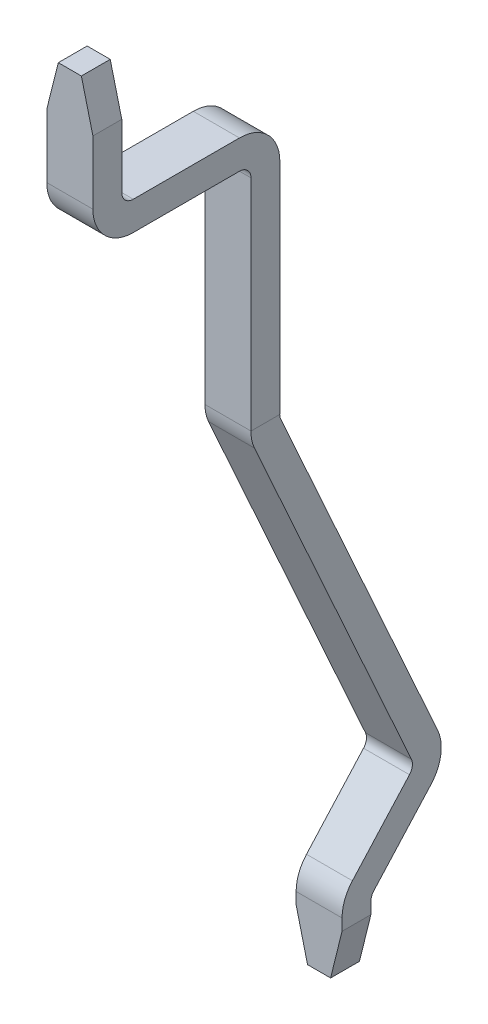
ISO-10303-21;
HEADER;
FILE_DESCRIPTION(('STEP AP214'),'2;1');
FILE_NAME('part.step','',(''),(''),'','','');
FILE_SCHEMA(('AUTOMOTIVE_DESIGN { 1 0 10303 214 1 1 1 1 }'));
ENDSEC;
DATA;
#1=APPLICATION_CONTEXT('core data for automotive mechanical design processes');
#2=APPLICATION_PROTOCOL_DEFINITION('international standard','automotive_design',2000,#1);
#3=PRODUCT_CONTEXT('',#1,'mechanical');
#4=PRODUCT('Part','Part','',(#3));
#5=PRODUCT_RELATED_PRODUCT_CATEGORY('part','',(#4));
#6=PRODUCT_DEFINITION_FORMATION('','',#4);
#7=PRODUCT_DEFINITION_CONTEXT('part definition',#1,'design');
#8=PRODUCT_DEFINITION('design','',#6,#7);
#9=PRODUCT_DEFINITION_SHAPE('','',#8);
#10=(LENGTH_UNIT() NAMED_UNIT(*) SI_UNIT(.MILLI.,.METRE.));
#11=(NAMED_UNIT(*) PLANE_ANGLE_UNIT() SI_UNIT($,.RADIAN.));
#12=(NAMED_UNIT(*) SI_UNIT($,.STERADIAN.) SOLID_ANGLE_UNIT());
#13=UNCERTAINTY_MEASURE_WITH_UNIT(LENGTH_MEASURE(1.E-05),#10,'distance_accuracy_value','');
#14=(GEOMETRIC_REPRESENTATION_CONTEXT(3) GLOBAL_UNCERTAINTY_ASSIGNED_CONTEXT((#13)) GLOBAL_UNIT_ASSIGNED_CONTEXT((#10,
#11,#12)) REPRESENTATION_CONTEXT('',''));
#15=CARTESIAN_POINT('',(0.,0.,0.));
#16=DIRECTION('',(0.,0.,1.));
#17=DIRECTION('',(1.,0.,0.));
#18=AXIS2_PLACEMENT_3D('',#15,#16,#17);
#19=CARTESIAN_POINT('',(0.,4.575,1.945));
#20=DIRECTION('',(0.,-1.,0.));
#21=DIRECTION('',(0.,0.,-1.));
#22=AXIS2_PLACEMENT_3D('',#19,#20,#21);
#23=PLANE('',#22);
#24=DIRECTION('',(0.,0.,1.));
#25=VECTOR('',#24,1.);
#26=CARTESIAN_POINT('',(-0.0999999999999935,4.575,8.99552393868072));
#27=LINE('',#26,#25);
#28=CARTESIAN_POINT('',(-0.0999999999999935,4.575,1.82));
#29=VERTEX_POINT('',#28);
#30=CARTESIAN_POINT('',(-0.0999999999999935,4.575,2.07));
#31=VERTEX_POINT('',#30);
#32=EDGE_CURVE('E264',#29,#31,#27,.T.);
#33=ORIENTED_EDGE('',*,*,#32,.T.);
#34=DIRECTION('',(-1.,0.,0.));
#35=VECTOR('',#34,1.);
#36=CARTESIAN_POINT('',(0.200000000000006,4.575,2.07));
#37=LINE('',#36,#35);
#38=CARTESIAN_POINT('',(0.100000000000006,4.575,2.07));
#39=VERTEX_POINT('',#38);
#40=EDGE_CURVE('E235',#31,#39,#37,.F.);
#41=ORIENTED_EDGE('',*,*,#40,.T.);
#42=DIRECTION('',(0.,0.,1.));
#43=VECTOR('',#42,1.);
#44=CARTESIAN_POINT('',(0.100000000000006,4.575,8.99552883706733));
#45=LINE('',#44,#43);
#46=CARTESIAN_POINT('',(0.100000000000006,4.575,1.82));
#47=VERTEX_POINT('',#46);
#48=EDGE_CURVE('E214',#47,#39,#45,.T.);
#49=ORIENTED_EDGE('',*,*,#48,.F.);
#50=DIRECTION('',(1.,0.,0.));
#51=VECTOR('',#50,1.);
#52=CARTESIAN_POINT('',(-0.199999999999994,4.575,1.82));
#53=LINE('',#52,#51);
#54=EDGE_CURVE('E251',#47,#29,#53,.F.);
#55=ORIENTED_EDGE('',*,*,#54,.T.);
#56=EDGE_LOOP('',(#33,#41,#49,#55));
#57=FACE_BOUND('',#56,.T.);
#58=ADVANCED_FACE('F17',(#57),#23,.F.);
#59=CARTESIAN_POINT('',(-0.0999999999999935,4.575,8.99552393868072));
#60=DIRECTION('',(0.970142500145331,-0.242535625036336,0.));
#61=DIRECTION('',(0.242535625036336,0.970142500145331,0.));
#62=AXIS2_PLACEMENT_3D('',#59,#60,#61);
#63=PLANE('',#62);
#64=DIRECTION('',(0.242535625036333,0.970142500145332,0.));
#65=VECTOR('',#64,1.);
#66=CARTESIAN_POINT('',(-0.199999999999994,4.175,2.07));
#67=LINE('',#66,#65);
#68=CARTESIAN_POINT('',(-0.199999999999994,4.175,2.07));
#69=VERTEX_POINT('',#68);
#70=EDGE_CURVE('E202',#69,#31,#67,.T.);
#71=ORIENTED_EDGE('',*,*,#70,.T.);
#72=ORIENTED_EDGE('',*,*,#32,.F.);
#73=DIRECTION('',(-0.242535625036333,-0.970142500145332,0.));
#74=VECTOR('',#73,1.);
#75=CARTESIAN_POINT('',(-0.0999999999999935,4.575,1.82));
#76=LINE('',#75,#74);
#77=CARTESIAN_POINT('',(-0.199999999999994,4.175,1.82));
#78=VERTEX_POINT('',#77);
#79=EDGE_CURVE('E231',#29,#78,#76,.T.);
#80=ORIENTED_EDGE('',*,*,#79,.T.);
#81=DIRECTION('',(0.,0.,1.));
#82=VECTOR('',#81,1.);
#83=CARTESIAN_POINT('',(-0.199999999999994,4.175,2.07));
#84=LINE('',#83,#82);
#85=EDGE_CURVE('E242',#78,#69,#84,.T.);
#86=ORIENTED_EDGE('',*,*,#85,.T.);
#87=EDGE_LOOP('',(#71,#72,#80,#86));
#88=FACE_BOUND('',#87,.T.);
#89=ADVANCED_FACE('F401',(#88),#63,.F.);
#90=CARTESIAN_POINT('',(-0.199999999999994,4.575,1.82));
#91=DIRECTION('',(0.,0.,1.));
#92=DIRECTION('',(0.,-1.,0.));
#93=AXIS2_PLACEMENT_3D('',#90,#91,#92);
#94=PLANE('',#93);
#95=ORIENTED_EDGE('',*,*,#79,.F.);
#96=ORIENTED_EDGE('',*,*,#54,.F.);
#97=DIRECTION('',(-0.242535625036336,0.970142500145331,0.));
#98=VECTOR('',#97,1.);
#99=CARTESIAN_POINT('',(0.100000000000006,4.575,1.82));
#100=LINE('',#99,#98);
#101=CARTESIAN_POINT('',(0.200000000000007,4.175,1.82));
#102=VERTEX_POINT('',#101);
#103=EDGE_CURVE('E232',#102,#47,#100,.T.);
#104=ORIENTED_EDGE('',*,*,#103,.F.);
#105=DIRECTION('',(0.,1.,0.));
#106=VECTOR('',#105,1.);
#107=CARTESIAN_POINT('',(0.200000000000006,4.575,1.82));
#108=LINE('',#107,#106);
#109=CARTESIAN_POINT('',(0.200000000000006,3.625,1.82));
#110=VERTEX_POINT('',#109);
#111=EDGE_CURVE('E221',#102,#110,#108,.F.);
#112=ORIENTED_EDGE('',*,*,#111,.T.);
#113=DIRECTION('',(1.,0.,0.));
#114=VECTOR('',#113,1.);
#115=CARTESIAN_POINT('',(0.,3.625,1.81999999999999));
#116=LINE('',#115,#114);
#117=CARTESIAN_POINT('',(-0.199999999999994,3.625,1.82));
#118=VERTEX_POINT('',#117);
#119=EDGE_CURVE('E229',#110,#118,#116,.F.);
#120=ORIENTED_EDGE('',*,*,#119,.T.);
#121=DIRECTION('',(0.,1.,0.));
#122=VECTOR('',#121,1.);
#123=CARTESIAN_POINT('',(-0.199999999999994,4.575,1.82));
#124=LINE('',#123,#122);
#125=EDGE_CURVE('E246',#118,#78,#124,.T.);
#126=ORIENTED_EDGE('',*,*,#125,.T.);
#127=EDGE_LOOP('',(#95,#96,#104,#112,#120,#126));
#128=FACE_BOUND('',#127,.T.);
#129=ADVANCED_FACE('F396',(#128),#94,.F.);
#130=CARTESIAN_POINT('',(0.,3.625,1.72));
#131=DIRECTION('',(1.,0.,0.));
#132=DIRECTION('',(0.,1.,0.));
#133=AXIS2_PLACEMENT_3D('',#130,#131,#132);
#134=CYLINDRICAL_SURFACE('',#133,0.0999999999999946);
#135=ORIENTED_EDGE('',*,*,#119,.F.);
#136=CARTESIAN_POINT('',(0.200000000000006,3.625,1.72));
#137=DIRECTION('',(1.,0.,0.));
#138=DIRECTION('',(0.,1.,0.));
#139=AXIS2_PLACEMENT_3D('',#136,#137,#138);
#140=CIRCLE('',#139,0.0999999999999946);
#141=CARTESIAN_POINT('',(0.200000000000006,3.525,1.72));
#142=VERTEX_POINT('',#141);
#143=EDGE_CURVE('E335',#110,#142,#140,.T.);
#144=ORIENTED_EDGE('',*,*,#143,.T.);
#145=DIRECTION('',(1.,0.,0.));
#146=VECTOR('',#145,1.);
#147=CARTESIAN_POINT('',(-0.199999999999994,3.525,1.72));
#148=LINE('',#147,#146);
#149=CARTESIAN_POINT('',(-0.199999999999994,3.525,1.72));
#150=VERTEX_POINT('',#149);
#151=EDGE_CURVE('E227',#142,#150,#148,.F.);
#152=ORIENTED_EDGE('',*,*,#151,.T.);
#153=CARTESIAN_POINT('',(-0.199999999999994,3.625,1.72));
#154=DIRECTION('',(1.,0.,0.));
#155=DIRECTION('',(0.,1.,0.));
#156=AXIS2_PLACEMENT_3D('',#153,#154,#155);
#157=CIRCLE('',#156,0.0999999999999946);
#158=EDGE_CURVE('E340',#150,#118,#157,.F.);
#159=ORIENTED_EDGE('',*,*,#158,.T.);
#160=EDGE_LOOP('',(#135,#144,#152,#159));
#161=FACE_BOUND('',#160,.T.);
#162=ADVANCED_FACE('F393',(#161),#134,.F.);
#163=CARTESIAN_POINT('',(-0.199999999999994,3.525,1.72));
#164=DIRECTION('',(0.,-1.,0.));
#165=DIRECTION('',(0.,0.,-1.));
#166=AXIS2_PLACEMENT_3D('',#163,#164,#165);
#167=PLANE('',#166);
#168=ORIENTED_EDGE('',*,*,#151,.F.);
#169=DIRECTION('',(0.,0.,1.));
#170=VECTOR('',#169,1.);
#171=CARTESIAN_POINT('',(0.200000000000006,3.525,1.82));
#172=LINE('',#171,#170);
#173=CARTESIAN_POINT('',(0.200000000000006,3.525,0.800000000000004));
#174=VERTEX_POINT('',#173);
#175=EDGE_CURVE('E334',#142,#174,#172,.F.);
#176=ORIENTED_EDGE('',*,*,#175,.T.);
#177=DIRECTION('',(-1.,0.,0.));
#178=VECTOR('',#177,1.);
#179=CARTESIAN_POINT('',(0.,3.525,0.800000000000004));
#180=LINE('',#179,#178);
#181=CARTESIAN_POINT('',(-0.199999999999994,3.525,0.800000000000004));
#182=VERTEX_POINT('',#181);
#183=EDGE_CURVE('E178',#182,#174,#180,.F.);
#184=ORIENTED_EDGE('',*,*,#183,.F.);
#185=DIRECTION('',(0.,0.,1.));
#186=VECTOR('',#185,1.);
#187=CARTESIAN_POINT('',(-0.199999999999994,3.525,2.07));
#188=LINE('',#187,#186);
#189=EDGE_CURVE('E343',#182,#150,#188,.T.);
#190=ORIENTED_EDGE('',*,*,#189,.T.);
#191=EDGE_LOOP('',(#168,#176,#184,#190));
#192=FACE_BOUND('',#191,.T.);
#193=ADVANCED_FACE('F384',(#192),#167,.F.);
#194=CARTESIAN_POINT('',(0.,3.175,0.800000000000004));
#195=DIRECTION('',(-1.,0.,0.));
#196=DIRECTION('',(0.,-1.,0.));
#197=AXIS2_PLACEMENT_3D('',#194,#195,#196);
#198=CYLINDRICAL_SURFACE('',#197,0.350000000000005);
#199=CARTESIAN_POINT('',(0.200000000000006,3.175,0.800000000000004));
#200=DIRECTION('',(-1.,0.,0.));
#201=DIRECTION('',(0.,-1.,0.));
#202=AXIS2_PLACEMENT_3D('',#199,#200,#201);
#203=CIRCLE('',#202,0.350000000000005);
#204=CARTESIAN_POINT('',(0.200000000000004,3.175,0.45));
#205=VERTEX_POINT('',#204);
#206=EDGE_CURVE('E330',#174,#205,#203,.T.);
#207=ORIENTED_EDGE('',*,*,#206,.T.);
#208=DIRECTION('',(1.,0.,0.));
#209=VECTOR('',#208,1.);
#210=CARTESIAN_POINT('',(-0.199999999999994,3.175,0.45));
#211=LINE('',#210,#209);
#212=CARTESIAN_POINT('',(-0.199999999999994,3.175,0.45));
#213=VERTEX_POINT('',#212);
#214=EDGE_CURVE('E218',#205,#213,#211,.F.);
#215=ORIENTED_EDGE('',*,*,#214,.T.);
#216=CARTESIAN_POINT('',(-0.199999999999994,3.175,0.800000000000004));
#217=DIRECTION('',(-1.,0.,0.));
#218=DIRECTION('',(0.,-1.,0.));
#219=AXIS2_PLACEMENT_3D('',#216,#217,#218);
#220=CIRCLE('',#219,0.350000000000005);
#221=EDGE_CURVE('E188',#213,#182,#220,.F.);
#222=ORIENTED_EDGE('',*,*,#221,.T.);
#223=ORIENTED_EDGE('',*,*,#183,.T.);
#224=EDGE_LOOP('',(#207,#215,#222,#223));
#225=FACE_BOUND('',#224,.T.);
#226=ADVANCED_FACE('F389',(#225),#198,.T.);
#227=CARTESIAN_POINT('',(-0.199999999999994,3.175,0.45));
#228=DIRECTION('',(0.,0.,1.));
#229=DIRECTION('',(0.,-1.,0.));
#230=AXIS2_PLACEMENT_3D('',#227,#228,#229);
#231=PLANE('',#230);
#232=ORIENTED_EDGE('',*,*,#214,.F.);
#233=DIRECTION('',(0.,1.,0.));
#234=VECTOR('',#233,1.);
#235=CARTESIAN_POINT('',(0.200000000000002,4.575,0.449999999999999));
#236=LINE('',#235,#234);
#237=CARTESIAN_POINT('',(0.200000000000002,1.275,0.449999999999999));
#238=VERTEX_POINT('',#237);
#239=EDGE_CURVE('E333',#205,#238,#236,.F.);
#240=ORIENTED_EDGE('',*,*,#239,.T.);
#241=DIRECTION('',(1.,0.,0.));
#242=VECTOR('',#241,1.);
#243=CARTESIAN_POINT('',(0.198999999999996,1.275,0.449999999999998));
#244=LINE('',#243,#242);
#245=CARTESIAN_POINT('',(0.199000000000002,1.275,0.449999999999999));
#246=VERTEX_POINT('',#245);
#247=EDGE_CURVE('E224',#246,#238,#244,.T.);
#248=ORIENTED_EDGE('',*,*,#247,.F.);
#249=DIRECTION('',(1.,0.,0.));
#250=VECTOR('',#249,1.);
#251=CARTESIAN_POINT('',(-0.199999999999994,1.275,0.45));
#252=LINE('',#251,#250);
#253=CARTESIAN_POINT('',(-0.198999999999989,1.275,0.449999999999999));
#254=VERTEX_POINT('',#253);
#255=EDGE_CURVE('E174',#254,#246,#252,.T.);
#256=ORIENTED_EDGE('',*,*,#255,.F.);
#257=DIRECTION('',(1.,0.,0.));
#258=VECTOR('',#257,1.);
#259=CARTESIAN_POINT('',(-0.19899999999999,1.275,0.45));
#260=LINE('',#259,#258);
#261=CARTESIAN_POINT('',(-0.199999999999994,1.275,0.45));
#262=VERTEX_POINT('',#261);
#263=EDGE_CURVE('E20',#262,#254,#260,.T.);
#264=ORIENTED_EDGE('',*,*,#263,.F.);
#265=DIRECTION('',(0.,1.,0.));
#266=VECTOR('',#265,1.);
#267=CARTESIAN_POINT('',(-0.199999999999994,4.575,0.45));
#268=LINE('',#267,#266);
#269=EDGE_CURVE('E172',#262,#213,#268,.T.);
#270=ORIENTED_EDGE('',*,*,#269,.T.);
#271=EDGE_LOOP('',(#232,#240,#248,#256,#264,#270));
#272=FACE_BOUND('',#271,.T.);
#273=ADVANCED_FACE('F171',(#272),#231,.F.);
#274=CARTESIAN_POINT('',(0.200000000000006,3.275,1.72));
#275=DIRECTION('',(0.,1.,0.));
#276=DIRECTION('',(0.,0.,1.));
#277=AXIS2_PLACEMENT_3D('',#274,#275,#276);
#278=PLANE('',#277);
#279=DIRECTION('',(1.,0.,0.));
#280=VECTOR('',#279,1.);
#281=CARTESIAN_POINT('',(0.,3.27500000000001,1.72));
#282=LINE('',#281,#280);
#283=CARTESIAN_POINT('',(-0.199999999999994,3.275,1.72));
#284=VERTEX_POINT('',#283);
#285=CARTESIAN_POINT('',(0.200000000000006,3.275,1.72));
#286=VERTEX_POINT('',#285);
#287=EDGE_CURVE('E203',#284,#286,#282,.T.);
#288=ORIENTED_EDGE('',*,*,#287,.F.);
#289=DIRECTION('',(0.,0.,1.));
#290=VECTOR('',#289,1.);
#291=CARTESIAN_POINT('',(-0.199999999999994,3.275,2.07));
#292=LINE('',#291,#290);
#293=CARTESIAN_POINT('',(-0.199999999999994,3.275,0.800000000000004));
#294=VERTEX_POINT('',#293);
#295=EDGE_CURVE('E194',#284,#294,#292,.F.);
#296=ORIENTED_EDGE('',*,*,#295,.T.);
#297=DIRECTION('',(-1.,0.,0.));
#298=VECTOR('',#297,1.);
#299=CARTESIAN_POINT('',(0.,3.275,0.800000000000004));
#300=LINE('',#299,#298);
#301=CARTESIAN_POINT('',(0.200000000000006,3.275,0.800000000000004));
#302=VERTEX_POINT('',#301);
#303=EDGE_CURVE('E219',#294,#302,#300,.F.);
#304=ORIENTED_EDGE('',*,*,#303,.T.);
#305=DIRECTION('',(0.,0.,1.));
#306=VECTOR('',#305,1.);
#307=CARTESIAN_POINT('',(0.200000000000006,3.275,1.82));
#308=LINE('',#307,#306);
#309=EDGE_CURVE('E325',#302,#286,#308,.T.);
#310=ORIENTED_EDGE('',*,*,#309,.T.);
#311=EDGE_LOOP('',(#288,#296,#304,#310));
#312=FACE_BOUND('',#311,.T.);
#313=ADVANCED_FACE('F535',(#312),#278,.F.);
#314=CARTESIAN_POINT('',(0.,3.625,1.72));
#315=DIRECTION('',(1.,0.,0.));
#316=DIRECTION('',(0.,1.,0.));
#317=AXIS2_PLACEMENT_3D('',#314,#315,#316);
#318=CYLINDRICAL_SURFACE('',#317,0.349999999999995);
#319=CARTESIAN_POINT('',(-0.199999999999994,3.625,1.72));
#320=DIRECTION('',(1.,0.,0.));
#321=DIRECTION('',(0.,1.,0.));
#322=AXIS2_PLACEMENT_3D('',#319,#320,#321);
#323=CIRCLE('',#322,0.349999999999995);
#324=CARTESIAN_POINT('',(-0.199999999999994,3.625,2.07));
#325=VERTEX_POINT('',#324);
#326=EDGE_CURVE('E196',#325,#284,#323,.T.);
#327=ORIENTED_EDGE('',*,*,#326,.T.);
#328=ORIENTED_EDGE('',*,*,#287,.T.);
#329=CARTESIAN_POINT('',(0.200000000000007,3.625,1.72));
#330=DIRECTION('',(1.,0.,0.));
#331=DIRECTION('',(0.,1.,0.));
#332=AXIS2_PLACEMENT_3D('',#329,#330,#331);
#333=CIRCLE('',#332,0.349999999999995);
#334=CARTESIAN_POINT('',(0.200000000000007,3.625,2.07));
#335=VERTEX_POINT('',#334);
#336=EDGE_CURVE('E322',#286,#335,#333,.F.);
#337=ORIENTED_EDGE('',*,*,#336,.T.);
#338=DIRECTION('',(-1.,0.,0.));
#339=VECTOR('',#338,1.);
#340=CARTESIAN_POINT('',(0.200000000000006,3.625,2.07));
#341=LINE('',#340,#339);
#342=EDGE_CURVE('E199',#335,#325,#341,.T.);
#343=ORIENTED_EDGE('',*,*,#342,.T.);
#344=EDGE_LOOP('',(#327,#328,#337,#343));
#345=FACE_BOUND('',#344,.T.);
#346=ADVANCED_FACE('F532',(#345),#318,.T.);
#347=CARTESIAN_POINT('',(0.200000000000006,4.575,2.07));
#348=DIRECTION('',(0.,0.,-1.));
#349=DIRECTION('',(-1.,0.,0.));
#350=AXIS2_PLACEMENT_3D('',#347,#348,#349);
#351=PLANE('',#350);
#352=ORIENTED_EDGE('',*,*,#70,.F.);
#353=DIRECTION('',(0.,1.,0.));
#354=VECTOR('',#353,1.);
#355=CARTESIAN_POINT('',(-0.199999999999994,4.575,2.07));
#356=LINE('',#355,#354);
#357=EDGE_CURVE('E245',#69,#325,#356,.F.);
#358=ORIENTED_EDGE('',*,*,#357,.T.);
#359=ORIENTED_EDGE('',*,*,#342,.F.);
#360=DIRECTION('',(0.,1.,0.));
#361=VECTOR('',#360,1.);
#362=CARTESIAN_POINT('',(0.200000000000007,4.575,2.07));
#363=LINE('',#362,#361);
#364=CARTESIAN_POINT('',(0.200000000000007,4.175,2.07));
#365=VERTEX_POINT('',#364);
#366=EDGE_CURVE('E208',#335,#365,#363,.T.);
#367=ORIENTED_EDGE('',*,*,#366,.T.);
#368=DIRECTION('',(-0.242535625036336,0.970142500145331,0.));
#369=VECTOR('',#368,1.);
#370=CARTESIAN_POINT('',(0.100000000000006,4.575,2.07));
#371=LINE('',#370,#369);
#372=EDGE_CURVE('E211',#39,#365,#371,.F.);
#373=ORIENTED_EDGE('',*,*,#372,.F.);
#374=ORIENTED_EDGE('',*,*,#40,.F.);
#375=EDGE_LOOP('',(#352,#358,#359,#367,#373,#374));
#376=FACE_BOUND('',#375,.T.);
#377=ADVANCED_FACE('F528',(#376),#351,.F.);
#378=CARTESIAN_POINT('',(0.100000000000006,4.575,8.99552883706733));
#379=DIRECTION('',(0.970142500145331,0.242535625036336,0.));
#380=DIRECTION('',(-0.242535625036336,0.970142500145331,0.));
#381=AXIS2_PLACEMENT_3D('',#378,#379,#380);
#382=PLANE('',#381);
#383=ORIENTED_EDGE('',*,*,#372,.T.);
#384=DIRECTION('',(0.,0.,1.));
#385=VECTOR('',#384,1.);
#386=CARTESIAN_POINT('',(0.200000000000006,4.175,1.82));
#387=LINE('',#386,#385);
#388=EDGE_CURVE('E204',#365,#102,#387,.F.);
#389=ORIENTED_EDGE('',*,*,#388,.T.);
#390=ORIENTED_EDGE('',*,*,#103,.T.);
#391=ORIENTED_EDGE('',*,*,#48,.T.);
#392=EDGE_LOOP('',(#383,#389,#390,#391));
#393=FACE_BOUND('',#392,.T.);
#394=ADVANCED_FACE('F525',(#393),#382,.T.);
#395=CARTESIAN_POINT('',(-0.199999999999994,4.575,2.07));
#396=DIRECTION('',(1.,0.,0.));
#397=DIRECTION('',(0.,1.,0.));
#398=AXIS2_PLACEMENT_3D('',#395,#396,#397);
#399=PLANE('',#398);
#400=ORIENTED_EDGE('',*,*,#85,.F.);
#401=ORIENTED_EDGE('',*,*,#125,.F.);
#402=ORIENTED_EDGE('',*,*,#158,.F.);
#403=ORIENTED_EDGE('',*,*,#189,.F.);
#404=ORIENTED_EDGE('',*,*,#221,.F.);
#405=ORIENTED_EDGE('',*,*,#269,.F.);
#406=DIRECTION('',(0.,0.,1.));
#407=VECTOR('',#406,1.);
#408=CARTESIAN_POINT('',(-0.199999999999994,1.275,2.07));
#409=LINE('',#408,#407);
#410=CARTESIAN_POINT('',(-0.199999999999992,1.275,0.7));
#411=VERTEX_POINT('',#410);
#412=EDGE_CURVE('E184',#411,#262,#409,.F.);
#413=ORIENTED_EDGE('',*,*,#412,.F.);
#414=DIRECTION('',(0.,1.,0.));
#415=VECTOR('',#414,1.);
#416=CARTESIAN_POINT('',(-0.19999999999999,3.175,0.7));
#417=LINE('',#416,#415);
#418=CARTESIAN_POINT('',(-0.199999999999992,3.175,0.7));
#419=VERTEX_POINT('',#418);
#420=EDGE_CURVE('E207',#411,#419,#417,.T.);
#421=ORIENTED_EDGE('',*,*,#420,.T.);
#422=CARTESIAN_POINT('',(-0.199999999999994,3.175,0.800000000000004));
#423=DIRECTION('',(-1.,0.,0.));
#424=DIRECTION('',(0.,-1.,0.));
#425=AXIS2_PLACEMENT_3D('',#422,#423,#424);
#426=CIRCLE('',#425,0.100000000000005);
#427=EDGE_CURVE('E222',#419,#294,#426,.F.);
#428=ORIENTED_EDGE('',*,*,#427,.T.);
#429=ORIENTED_EDGE('',*,*,#295,.F.);
#430=ORIENTED_EDGE('',*,*,#326,.F.);
#431=ORIENTED_EDGE('',*,*,#357,.F.);
#432=EDGE_LOOP('',(#400,#401,#402,#403,#404,#405,#413,#421,#428,#429,#430,#431));
#433=FACE_BOUND('',#432,.T.);
#434=ADVANCED_FACE('F182',(#433),#399,.F.);
#435=CARTESIAN_POINT('',(0.,3.175,0.800000000000004));
#436=DIRECTION('',(-1.,0.,0.));
#437=DIRECTION('',(0.,-1.,0.));
#438=AXIS2_PLACEMENT_3D('',#435,#436,#437);
#439=CYLINDRICAL_SURFACE('',#438,0.100000000000005);
#440=ORIENTED_EDGE('',*,*,#303,.F.);
#441=ORIENTED_EDGE('',*,*,#427,.F.);
#442=DIRECTION('',(-1.,0.,0.));
#443=VECTOR('',#442,1.);
#444=CARTESIAN_POINT('',(0.200000000000006,3.175,0.7));
#445=LINE('',#444,#443);
#446=CARTESIAN_POINT('',(0.200000000000006,3.175,0.7));
#447=VERTEX_POINT('',#446);
#448=EDGE_CURVE('E371',#419,#447,#445,.F.);
#449=ORIENTED_EDGE('',*,*,#448,.T.);
#450=CARTESIAN_POINT('',(0.200000000000006,3.175,0.800000000000004));
#451=DIRECTION('',(-1.,0.,0.));
#452=DIRECTION('',(0.,-1.,0.));
#453=AXIS2_PLACEMENT_3D('',#450,#451,#452);
#454=CIRCLE('',#453,0.100000000000005);
#455=EDGE_CURVE('E326',#447,#302,#454,.F.);
#456=ORIENTED_EDGE('',*,*,#455,.T.);
#457=EDGE_LOOP('',(#440,#441,#449,#456));
#458=FACE_BOUND('',#457,.T.);
#459=ADVANCED_FACE('F519',(#458),#439,.F.);
#460=CARTESIAN_POINT('',(0.200000000000006,4.575,1.82));
#461=DIRECTION('',(-1.,0.,0.));
#462=DIRECTION('',(0.,0.,1.));
#463=AXIS2_PLACEMENT_3D('',#460,#461,#462);
#464=PLANE('',#463);
#465=ORIENTED_EDGE('',*,*,#366,.F.);
#466=ORIENTED_EDGE('',*,*,#336,.F.);
#467=ORIENTED_EDGE('',*,*,#309,.F.);
#468=ORIENTED_EDGE('',*,*,#455,.F.);
#469=DIRECTION('',(0.,1.,0.));
#470=VECTOR('',#469,1.);
#471=CARTESIAN_POINT('',(0.200000000000006,3.175,0.7));
#472=LINE('',#471,#470);
#473=CARTESIAN_POINT('',(0.200000000000004,1.275,0.7));
#474=VERTEX_POINT('',#473);
#475=EDGE_CURVE('E359',#447,#474,#472,.F.);
#476=ORIENTED_EDGE('',*,*,#475,.T.);
#477=DIRECTION('',(0.,0.,1.));
#478=VECTOR('',#477,1.);
#479=CARTESIAN_POINT('',(0.200000000000006,1.275,1.82));
#480=LINE('',#479,#478);
#481=EDGE_CURVE('E329',#238,#474,#480,.T.);
#482=ORIENTED_EDGE('',*,*,#481,.F.);
#483=ORIENTED_EDGE('',*,*,#239,.F.);
#484=ORIENTED_EDGE('',*,*,#206,.F.);
#485=ORIENTED_EDGE('',*,*,#175,.F.);
#486=ORIENTED_EDGE('',*,*,#143,.F.);
#487=ORIENTED_EDGE('',*,*,#111,.F.);
#488=ORIENTED_EDGE('',*,*,#388,.F.);
#489=EDGE_LOOP('',(#465,#466,#467,#468,#476,#482,#483,#484,#485,#486,#487,#488));
#490=FACE_BOUND('',#489,.T.);
#491=ADVANCED_FACE('F356',(#490),#464,.F.);
#492=CARTESIAN_POINT('',(0.200000000000006,3.175,0.7));
#493=DIRECTION('',(0.,0.,-1.));
#494=DIRECTION('',(-1.,0.,0.));
#495=AXIS2_PLACEMENT_3D('',#492,#493,#494);
#496=PLANE('',#495);
#497=ORIENTED_EDGE('',*,*,#448,.F.);
#498=ORIENTED_EDGE('',*,*,#420,.F.);
#499=DIRECTION('',(-1.,0.,0.));
#500=VECTOR('',#499,1.);
#501=CARTESIAN_POINT('',(0.200000000000006,1.275,0.7));
#502=LINE('',#501,#500);
#503=CARTESIAN_POINT('',(-0.198999999999987,1.275,0.699999999999999));
#504=VERTEX_POINT('',#503);
#505=EDGE_CURVE('E193',#411,#504,#502,.F.);
#506=ORIENTED_EDGE('',*,*,#505,.T.);
#507=DIRECTION('',(1.,0.,0.));
#508=VECTOR('',#507,1.);
#509=CARTESIAN_POINT('',(0.,1.275,0.699999999999998));
#510=LINE('',#509,#508);
#511=CARTESIAN_POINT('',(0.199000000000003,1.275,0.699999999999999));
#512=VERTEX_POINT('',#511);
#513=EDGE_CURVE('E316',#512,#504,#510,.F.);
#514=ORIENTED_EDGE('',*,*,#513,.F.);
#515=DIRECTION('',(-1.,0.,0.));
#516=VECTOR('',#515,1.);
#517=CARTESIAN_POINT('',(0.200000000000006,1.275,0.7));
#518=LINE('',#517,#516);
#519=EDGE_CURVE('E317',#512,#474,#518,.F.);
#520=ORIENTED_EDGE('',*,*,#519,.T.);
#521=ORIENTED_EDGE('',*,*,#475,.F.);
#522=EDGE_LOOP('',(#497,#498,#506,#514,#520,#521));
#523=FACE_BOUND('',#522,.T.);
#524=ADVANCED_FACE('F512',(#523),#496,.F.);
#525=CARTESIAN_POINT('',(0.,-3.275,-0.215));
#526=DIRECTION('',(0.,-1.,0.));
#527=DIRECTION('',(0.,0.,-1.));
#528=AXIS2_PLACEMENT_3D('',#525,#526,#527);
#529=PLANE('',#528);
#530=DIRECTION('',(1.,0.,0.));
#531=VECTOR('',#530,1.);
#532=CARTESIAN_POINT('',(0.200000000000006,-3.275,-0.0900000000000004));
#533=LINE('',#532,#531);
#534=CARTESIAN_POINT('',(0.100000000000006,-3.275,-0.0900000000000002));
#535=VERTEX_POINT('',#534);
#536=CARTESIAN_POINT('',(-0.0999999999999935,-3.275,-0.0900000000000002));
#537=VERTEX_POINT('',#536);
#538=EDGE_CURVE('E638',#535,#537,#533,.F.);
#539=ORIENTED_EDGE('',*,*,#538,.T.);
#540=DIRECTION('',(0.,0.,1.));
#541=VECTOR('',#540,1.);
#542=CARTESIAN_POINT('',(-0.0999999999999935,-3.275,-7.84552393868072));
#543=LINE('',#542,#541);
#544=CARTESIAN_POINT('',(-0.0999999999999935,-3.275,-0.34));
#545=VERTEX_POINT('',#544);
#546=EDGE_CURVE('E320',#537,#545,#543,.F.);
#547=ORIENTED_EDGE('',*,*,#546,.T.);
#548=DIRECTION('',(1.,0.,0.));
#549=VECTOR('',#548,1.);
#550=CARTESIAN_POINT('',(-0.199999999999994,-3.275,-0.34));
#551=LINE('',#550,#549);
#552=CARTESIAN_POINT('',(0.100000000000006,-3.275,-0.34));
#553=VERTEX_POINT('',#552);
#554=EDGE_CURVE('E595',#545,#553,#551,.T.);
#555=ORIENTED_EDGE('',*,*,#554,.T.);
#556=DIRECTION('',(0.,0.,1.));
#557=VECTOR('',#556,1.);
#558=CARTESIAN_POINT('',(0.100000000000006,-3.275,-7.84552393868072));
#559=LINE('',#558,#557);
#560=EDGE_CURVE('E321',#535,#553,#559,.F.);
#561=ORIENTED_EDGE('',*,*,#560,.F.);
#562=EDGE_LOOP('',(#539,#547,#555,#561));
#563=FACE_BOUND('',#562,.T.);
#564=ADVANCED_FACE('F508',(#563),#529,.T.);
#565=CARTESIAN_POINT('',(0.100000000000006,-3.275,-7.84552393868072));
#566=DIRECTION('',(0.970710817842158,-0.240250927415917,0.));
#567=DIRECTION('',(0.240250927415917,0.970710817842158,0.));
#568=AXIS2_PLACEMENT_3D('',#565,#566,#567);
#569=PLANE('',#568);
#570=DIRECTION('',(-0.240250927415917,-0.970710817842158,0.));
#571=VECTOR('',#570,1.);
#572=CARTESIAN_POINT('',(0.198999999999999,-2.875,-0.0900000000000001));
#573=LINE('',#572,#571);
#574=CARTESIAN_POINT('',(0.199,-2.875,-0.0900000000000001));
#575=VERTEX_POINT('',#574);
#576=EDGE_CURVE('E634',#575,#535,#573,.T.);
#577=ORIENTED_EDGE('',*,*,#576,.T.);
#578=ORIENTED_EDGE('',*,*,#560,.T.);
#579=DIRECTION('',(0.240250927415917,0.970710817842158,0.));
#580=VECTOR('',#579,1.);
#581=CARTESIAN_POINT('',(0.100000000000006,-3.275,-0.34));
#582=LINE('',#581,#580);
#583=CARTESIAN_POINT('',(0.198999999999999,-2.875,-0.34));
#584=VERTEX_POINT('',#583);
#585=EDGE_CURVE('E591',#553,#584,#582,.T.);
#586=ORIENTED_EDGE('',*,*,#585,.T.);
#587=DIRECTION('',(0.,0.,-1.));
#588=VECTOR('',#587,1.);
#589=CARTESIAN_POINT('',(0.199000000000002,-2.875,0.7));
#590=LINE('',#589,#588);
#591=EDGE_CURVE('E581',#575,#584,#590,.T.);
#592=ORIENTED_EDGE('',*,*,#591,.F.);
#593=EDGE_LOOP('',(#577,#578,#586,#592));
#594=FACE_BOUND('',#593,.T.);
#595=ADVANCED_FACE('F505',(#594),#569,.T.);
#596=CARTESIAN_POINT('',(0.198999999999996,1.275,-0.95));
#597=DIRECTION('',(0.,1.,0.));
#598=DIRECTION('',(0.,0.,1.));
#599=AXIS2_PLACEMENT_3D('',#596,#597,#598);
#600=PLANE('',#599);
#601=ORIENTED_EDGE('',*,*,#519,.F.);
#602=DIRECTION('',(0.,0.,-1.));
#603=VECTOR('',#602,1.);
#604=CARTESIAN_POINT('',(0.199000000000002,1.275,0.7));
#605=LINE('',#604,#603);
#606=EDGE_CURVE('E306',#246,#512,#605,.F.);
#607=ORIENTED_EDGE('',*,*,#606,.F.);
#608=ORIENTED_EDGE('',*,*,#247,.T.);
#609=ORIENTED_EDGE('',*,*,#481,.T.);
#610=EDGE_LOOP('',(#601,#607,#608,#609));
#611=FACE_BOUND('',#610,.T.);
#612=ADVANCED_FACE('F349',(#611),#600,.F.);
#613=CARTESIAN_POINT('',(-0.0999999999999935,-3.275,-7.84552393868072));
#614=DIRECTION('',(0.970710817842158,0.240250927415917,0.));
#615=DIRECTION('',(-0.240250927415917,0.970710817842158,0.));
#616=AXIS2_PLACEMENT_3D('',#613,#614,#615);
#617=PLANE('',#616);
#618=DIRECTION('',(-0.240250927415917,0.970710817842158,0.));
#619=VECTOR('',#618,1.);
#620=CARTESIAN_POINT('',(-0.0999999999999935,-3.275,-0.0900000000000004));
#621=LINE('',#620,#619);
#622=CARTESIAN_POINT('',(-0.198999999999987,-2.875,-0.0900000000000001));
#623=VERTEX_POINT('',#622);
#624=EDGE_CURVE('E635',#537,#623,#621,.T.);
#625=ORIENTED_EDGE('',*,*,#624,.T.);
#626=DIRECTION('',(0.,0.,1.));
#627=VECTOR('',#626,1.);
#628=CARTESIAN_POINT('',(-0.19899999999999,-2.875,0.7));
#629=LINE('',#628,#627);
#630=CARTESIAN_POINT('',(-0.198999999999986,-2.875,-0.34));
#631=VERTEX_POINT('',#630);
#632=EDGE_CURVE('E294',#631,#623,#629,.T.);
#633=ORIENTED_EDGE('',*,*,#632,.F.);
#634=DIRECTION('',(0.240250927415917,-0.970710817842158,0.));
#635=VECTOR('',#634,1.);
#636=CARTESIAN_POINT('',(-0.198999999999987,-2.875,-0.34));
#637=LINE('',#636,#635);
#638=EDGE_CURVE('E609',#631,#545,#637,.T.);
#639=ORIENTED_EDGE('',*,*,#638,.T.);
#640=ORIENTED_EDGE('',*,*,#546,.F.);
#641=EDGE_LOOP('',(#625,#633,#639,#640));
#642=FACE_BOUND('',#641,.T.);
#643=ADVANCED_FACE('F498',(#642),#617,.F.);
#644=CARTESIAN_POINT('',(0.200000000000006,-2.775,-0.0900000000000001));
#645=DIRECTION('',(0.,0.,-1.));
#646=DIRECTION('',(0.,1.,0.));
#647=AXIS2_PLACEMENT_3D('',#644,#645,#646);
#648=PLANE('',#647);
#649=DIRECTION('',(0.,1.,0.));
#650=VECTOR('',#649,1.);
#651=CARTESIAN_POINT('',(0.199,-3.275,-0.0900000000000001));
#652=LINE('',#651,#650);
#653=CARTESIAN_POINT('',(0.198999999999999,-2.775,-0.0900000000000025));
#654=VERTEX_POINT('',#653);
#655=EDGE_CURVE('E587',#654,#575,#652,.F.);
#656=ORIENTED_EDGE('',*,*,#655,.F.);
#657=DIRECTION('',(1.,0.,0.));
#658=VECTOR('',#657,1.);
#659=CARTESIAN_POINT('',(0.,-2.775,-0.090000000000005));
#660=LINE('',#659,#658);
#661=CARTESIAN_POINT('',(-0.198999999999987,-2.775,-0.0900000000000025));
#662=VERTEX_POINT('',#661);
#663=EDGE_CURVE('E632',#662,#654,#660,.T.);
#664=ORIENTED_EDGE('',*,*,#663,.F.);
#665=DIRECTION('',(0.,1.,0.));
#666=VECTOR('',#665,1.);
#667=CARTESIAN_POINT('',(-0.198999999999987,-3.275,-0.0900000000000001));
#668=LINE('',#667,#666);
#669=EDGE_CURVE('E290',#623,#662,#668,.T.);
#670=ORIENTED_EDGE('',*,*,#669,.F.);
#671=ORIENTED_EDGE('',*,*,#624,.F.);
#672=ORIENTED_EDGE('',*,*,#538,.F.);
#673=ORIENTED_EDGE('',*,*,#576,.F.);
#674=EDGE_LOOP('',(#656,#664,#670,#671,#672,#673));
#675=FACE_BOUND('',#674,.T.);
#676=ADVANCED_FACE('F494',(#675),#648,.F.);
#677=CARTESIAN_POINT('',(0.,-2.775,-0.44));
#678=DIRECTION('',(1.,0.,0.));
#679=DIRECTION('',(0.,1.,0.));
#680=AXIS2_PLACEMENT_3D('',#677,#678,#679);
#681=CYLINDRICAL_SURFACE('',#680,0.349999999999995);
#682=CARTESIAN_POINT('',(0.198999999999999,-2.775,-0.44));
#683=DIRECTION('',(1.,0.,0.));
#684=DIRECTION('',(0.,1.,0.));
#685=AXIS2_PLACEMENT_3D('',#682,#683,#684);
#686=CIRCLE('',#685,0.349999999999995);
#687=CARTESIAN_POINT('',(0.199,-2.54075423726739,-0.179944385482999));
#688=VERTEX_POINT('',#687);
#689=EDGE_CURVE('E295',#688,#654,#686,.T.);
#690=ORIENTED_EDGE('',*,*,#689,.F.);
#691=DIRECTION('',(1.,0.,0.));
#692=VECTOR('',#691,1.);
#693=CARTESIAN_POINT('',(0.200000000000006,-2.54075423726739,-0.179944385483));
#694=LINE('',#693,#692);
#695=CARTESIAN_POINT('',(-0.198999999999987,-2.54075423726739,-0.179944385482999));
#696=VERTEX_POINT('',#695);
#697=EDGE_CURVE('E629',#688,#696,#694,.F.);
#698=ORIENTED_EDGE('',*,*,#697,.T.);
#699=CARTESIAN_POINT('',(-0.198999999999987,-2.775,-0.44));
#700=DIRECTION('',(1.,0.,0.));
#701=DIRECTION('',(0.,1.,0.));
#702=AXIS2_PLACEMENT_3D('',#699,#700,#701);
#703=CIRCLE('',#702,0.349999999999995);
#704=EDGE_CURVE('E288',#662,#696,#703,.F.);
#705=ORIENTED_EDGE('',*,*,#704,.F.);
#706=ORIENTED_EDGE('',*,*,#663,.T.);
#707=EDGE_LOOP('',(#690,#698,#705,#706));
#708=FACE_BOUND('',#707,.T.);
#709=ADVANCED_FACE('F490',(#708),#681,.T.);
#710=CARTESIAN_POINT('',(0.200000000000006,-1.99192736078075,-0.67430160414772));
#711=DIRECTION('',(0.,-0.669273607807463,-0.743016041477155));
#712=DIRECTION('',(0.,0.743016041477155,-0.669273607807463));
#713=AXIS2_PLACEMENT_3D('',#710,#711,#712);
#714=PLANE('',#713);
#715=ORIENTED_EDGE('',*,*,#697,.F.);
#716=DIRECTION('',(0.,-0.743016041477151,0.669273607807469));
#717=VECTOR('',#716,1.);
#718=CARTESIAN_POINT('',(0.198999999999998,-1.99192736078075,-0.67430160414772));
#719=LINE('',#718,#717);
#720=CARTESIAN_POINT('',(0.198999999999997,-1.99192736078075,-0.67430160414772));
#721=VERTEX_POINT('',#720);
#722=EDGE_CURVE('E298',#721,#688,#719,.T.);
#723=ORIENTED_EDGE('',*,*,#722,.F.);
#724=DIRECTION('',(-1.,0.,0.));
#725=VECTOR('',#724,1.);
#726=CARTESIAN_POINT('',(0.,-1.99192736078075,-0.67430160414772));
#727=LINE('',#726,#725);
#728=CARTESIAN_POINT('',(-0.198999999999985,-1.99192736078075,-0.674301604147719));
#729=VERTEX_POINT('',#728);
#730=EDGE_CURVE('E626',#721,#729,#727,.T.);
#731=ORIENTED_EDGE('',*,*,#730,.T.);
#732=DIRECTION('',(0.,0.743016041477151,-0.669273607807469));
#733=VECTOR('',#732,1.);
#734=CARTESIAN_POINT('',(-0.198999999999987,-2.54075423726739,-0.179944385482996));
#735=LINE('',#734,#733);
#736=EDGE_CURVE('E287',#696,#729,#735,.T.);
#737=ORIENTED_EDGE('',*,*,#736,.F.);
#738=EDGE_LOOP('',(#715,#723,#731,#737));
#739=FACE_BOUND('',#738,.T.);
#740=ADVANCED_FACE('F486',(#739),#714,.F.);
#741=CARTESIAN_POINT('',(0.,-1.925,-0.6));
#742=DIRECTION('',(-1.,0.,0.));
#743=DIRECTION('',(0.,-1.,0.));
#744=AXIS2_PLACEMENT_3D('',#741,#742,#743);
#745=CYLINDRICAL_SURFACE('',#744,0.100000000000005);
#746=ORIENTED_EDGE('',*,*,#730,.F.);
#747=CARTESIAN_POINT('',(0.198999999999996,-1.925,-0.6));
#748=DIRECTION('',(-1.,0.,0.));
#749=DIRECTION('',(0.,-1.,0.));
#750=AXIS2_PLACEMENT_3D('',#747,#748,#749);
#751=CIRCLE('',#750,0.100000000000005);
#752=CARTESIAN_POINT('',(0.198999999999996,-1.88387647540836,-0.69115292494024));
#753=VERTEX_POINT('',#752);
#754=EDGE_CURVE('E299',#753,#721,#751,.T.);
#755=ORIENTED_EDGE('',*,*,#754,.F.);
#756=DIRECTION('',(1.,0.,0.));
#757=VECTOR('',#756,1.);
#758=CARTESIAN_POINT('',(0.200000000000006,-1.88387647540836,-0.691152924940239));
#759=LINE('',#758,#757);
#760=CARTESIAN_POINT('',(-0.198999999999985,-1.88387647540836,-0.69115292494024));
#761=VERTEX_POINT('',#760);
#762=EDGE_CURVE('E623',#753,#761,#759,.F.);
#763=ORIENTED_EDGE('',*,*,#762,.T.);
#764=CARTESIAN_POINT('',(-0.198999999999985,-1.925,-0.6));
#765=DIRECTION('',(-1.,0.,0.));
#766=DIRECTION('',(0.,-1.,0.));
#767=AXIS2_PLACEMENT_3D('',#764,#765,#766);
#768=CIRCLE('',#767,0.100000000000005);
#769=EDGE_CURVE('E285',#729,#761,#768,.F.);
#770=ORIENTED_EDGE('',*,*,#769,.F.);
#771=EDGE_LOOP('',(#746,#755,#763,#770));
#772=FACE_BOUND('',#771,.T.);
#773=ADVANCED_FACE('F482',(#772),#745,.F.);
#774=CARTESIAN_POINT('',(0.200000000000006,1.13106766392928,0.669035237290843));
#775=DIRECTION('',(0.,0.411235245916341,-0.911529249402413));
#776=DIRECTION('',(0.,0.911529249402413,0.411235245916341));
#777=AXIS2_PLACEMENT_3D('',#774,#775,#776);
#778=PLANE('',#777);
#779=ORIENTED_EDGE('',*,*,#762,.F.);
#780=DIRECTION('',(0.,-0.911529249402413,-0.411235245916341));
#781=VECTOR('',#780,1.);
#782=CARTESIAN_POINT('',(0.199000000000002,1.13106766392928,0.669035237290843));
#783=LINE('',#782,#781);
#784=CARTESIAN_POINT('',(0.199000000000002,1.13106766392928,0.669035237290843));
#785=VERTEX_POINT('',#784);
#786=EDGE_CURVE('E302',#785,#753,#783,.T.);
#787=ORIENTED_EDGE('',*,*,#786,.F.);
#788=DIRECTION('',(1.,0.,0.));
#789=VECTOR('',#788,1.);
#790=CARTESIAN_POINT('',(0.,1.13106766392928,0.669035237290842));
#791=LINE('',#790,#789);
#792=CARTESIAN_POINT('',(-0.198999999999987,1.13106766392928,0.669035237290843));
#793=VERTEX_POINT('',#792);
#794=EDGE_CURVE('E621',#793,#785,#791,.T.);
#795=ORIENTED_EDGE('',*,*,#794,.F.);
#796=DIRECTION('',(0.,0.911529249402413,0.411235245916341));
#797=VECTOR('',#796,1.);
#798=CARTESIAN_POINT('',(-0.198999999999985,-1.88387647540836,-0.69115292494024));
#799=LINE('',#798,#797);
#800=EDGE_CURVE('E284',#761,#793,#799,.T.);
#801=ORIENTED_EDGE('',*,*,#800,.F.);
#802=EDGE_LOOP('',(#779,#787,#795,#801));
#803=FACE_BOUND('',#802,.T.);
#804=ADVANCED_FACE('F478',(#803),#778,.F.);
#805=CARTESIAN_POINT('',(0.,1.275,0.350000000000003));
#806=DIRECTION('',(1.,0.,0.));
#807=DIRECTION('',(0.,1.,0.));
#808=AXIS2_PLACEMENT_3D('',#805,#806,#807);
#809=CYLINDRICAL_SURFACE('',#808,0.349999999999995);
#810=CARTESIAN_POINT('',(0.199000000000002,1.275,0.350000000000003));
#811=DIRECTION('',(1.,0.,0.));
#812=DIRECTION('',(0.,1.,0.));
#813=AXIS2_PLACEMENT_3D('',#810,#811,#812);
#814=CIRCLE('',#813,0.349999999999995);
#815=EDGE_CURVE('E303',#512,#785,#814,.T.);
#816=ORIENTED_EDGE('',*,*,#815,.F.);
#817=ORIENTED_EDGE('',*,*,#513,.T.);
#818=CARTESIAN_POINT('',(-0.198999999999984,1.275,0.350000000000003));
#819=DIRECTION('',(1.,0.,0.));
#820=DIRECTION('',(0.,1.,0.));
#821=AXIS2_PLACEMENT_3D('',#818,#819,#820);
#822=CIRCLE('',#821,0.349999999999995);
#823=EDGE_CURVE('E281',#793,#504,#822,.F.);
#824=ORIENTED_EDGE('',*,*,#823,.F.);
#825=ORIENTED_EDGE('',*,*,#794,.T.);
#826=EDGE_LOOP('',(#816,#817,#824,#825));
#827=FACE_BOUND('',#826,.T.);
#828=ADVANCED_FACE('F475',(#827),#809,.T.);
#829=CARTESIAN_POINT('',(-0.19899999999999,1.275,0.7));
#830=DIRECTION('',(0.,1.,0.));
#831=DIRECTION('',(0.,0.,1.));
#832=AXIS2_PLACEMENT_3D('',#829,#830,#831);
#833=PLANE('',#832);
#834=ORIENTED_EDGE('',*,*,#505,.F.);
#835=ORIENTED_EDGE('',*,*,#412,.T.);
#836=ORIENTED_EDGE('',*,*,#263,.T.);
#837=DIRECTION('',(0.,0.,1.));
#838=VECTOR('',#837,1.);
#839=CARTESIAN_POINT('',(-0.19899999999999,1.275,0.7));
#840=LINE('',#839,#838);
#841=EDGE_CURVE('E280',#504,#254,#840,.F.);
#842=ORIENTED_EDGE('',*,*,#841,.F.);
#843=EDGE_LOOP('',(#834,#835,#836,#842));
#844=FACE_BOUND('',#843,.T.);
#845=ADVANCED_FACE('F191',(#844),#833,.F.);
#846=CARTESIAN_POINT('',(-0.199999999999994,-2.15924576273261,-0.860055614517));
#847=DIRECTION('',(0.,0.669273607807463,0.743016041477155));
#848=DIRECTION('',(0.,-0.743016041477155,0.669273607807463));
#849=AXIS2_PLACEMENT_3D('',#846,#847,#848);
#850=PLANE('',#849);
#851=DIRECTION('',(-1.,0.,0.));
#852=VECTOR('',#851,1.);
#853=CARTESIAN_POINT('',(0.,-2.15924576273262,-0.860055614517007));
#854=LINE('',#853,#852);
#855=CARTESIAN_POINT('',(0.198999999999996,-2.15924576273261,-0.860055614517005));
#856=VERTEX_POINT('',#855);
#857=CARTESIAN_POINT('',(-0.198999999999984,-2.15924576273261,-0.860055614517005));
#858=VERTEX_POINT('',#857);
#859=EDGE_CURVE('E437',#856,#858,#854,.T.);
#860=ORIENTED_EDGE('',*,*,#859,.F.);
#861=DIRECTION('',(0.,0.743016041477162,-0.669273607807455));
#862=VECTOR('',#861,1.);
#863=CARTESIAN_POINT('',(0.198999999999999,-2.70807263921926,-0.365698395852285));
#864=LINE('',#863,#862);
#865=CARTESIAN_POINT('',(0.198999999999998,-2.70807263921926,-0.365698395852286));
#866=VERTEX_POINT('',#865);
#867=EDGE_CURVE('E309',#866,#856,#864,.T.);
#868=ORIENTED_EDGE('',*,*,#867,.F.);
#869=DIRECTION('',(1.,0.,0.));
#870=VECTOR('',#869,1.);
#871=CARTESIAN_POINT('',(0.,-2.70807263921926,-0.365698395852285));
#872=LINE('',#871,#870);
#873=CARTESIAN_POINT('',(-0.198999999999986,-2.70807263921926,-0.365698395852286));
#874=VERTEX_POINT('',#873);
#875=EDGE_CURVE('E315',#866,#874,#872,.F.);
#876=ORIENTED_EDGE('',*,*,#875,.T.);
#877=DIRECTION('',(0.,-0.743016041477162,0.669273607807455));
#878=VECTOR('',#877,1.);
#879=CARTESIAN_POINT('',(-0.198999999999984,-2.15924576273261,-0.860055614517));
#880=LINE('',#879,#878);
#881=EDGE_CURVE('E275',#858,#874,#880,.T.);
#882=ORIENTED_EDGE('',*,*,#881,.F.);
#883=EDGE_LOOP('',(#860,#868,#876,#882));
#884=FACE_BOUND('',#883,.T.);
#885=ADVANCED_FACE('F468',(#884),#850,.F.);
#886=CARTESIAN_POINT('',(0.,-2.775,-0.44));
#887=DIRECTION('',(1.,0.,0.));
#888=DIRECTION('',(0.,1.,0.));
#889=AXIS2_PLACEMENT_3D('',#886,#887,#888);
#890=CYLINDRICAL_SURFACE('',#889,0.0999999999999952);
#891=ORIENTED_EDGE('',*,*,#875,.F.);
#892=CARTESIAN_POINT('',(0.198999999999998,-2.775,-0.44));
#893=DIRECTION('',(1.,0.,0.));
#894=DIRECTION('',(0.,1.,0.));
#895=AXIS2_PLACEMENT_3D('',#892,#893,#894);
#896=CIRCLE('',#895,0.0999999999999952);
#897=CARTESIAN_POINT('',(0.198999999999999,-2.775,-0.34));
#898=VERTEX_POINT('',#897);
#899=EDGE_CURVE('E310',#898,#866,#896,.F.);
#900=ORIENTED_EDGE('',*,*,#899,.F.);
#901=DIRECTION('',(1.,0.,0.));
#902=VECTOR('',#901,1.);
#903=CARTESIAN_POINT('',(-0.199999999999994,-2.775,-0.34));
#904=LINE('',#903,#902);
#905=CARTESIAN_POINT('',(-0.198999999999986,-2.775,-0.34));
#906=VERTEX_POINT('',#905);
#907=EDGE_CURVE('E598',#898,#906,#904,.F.);
#908=ORIENTED_EDGE('',*,*,#907,.T.);
#909=CARTESIAN_POINT('',(-0.198999999999986,-2.775,-0.44));
#910=DIRECTION('',(1.,0.,0.));
#911=DIRECTION('',(0.,1.,0.));
#912=AXIS2_PLACEMENT_3D('',#909,#910,#911);
#913=CIRCLE('',#912,0.0999999999999952);
#914=EDGE_CURVE('E271',#874,#906,#913,.T.);
#915=ORIENTED_EDGE('',*,*,#914,.F.);
#916=EDGE_LOOP('',(#891,#900,#908,#915));
#917=FACE_BOUND('',#916,.T.);
#918=ADVANCED_FACE('F464',(#917),#890,.F.);
#919=CARTESIAN_POINT('',(-0.199999999999994,-2.775,-0.34));
#920=DIRECTION('',(0.,0.,1.));
#921=DIRECTION('',(0.,-1.,0.));
#922=AXIS2_PLACEMENT_3D('',#919,#920,#921);
#923=PLANE('',#922);
#924=ORIENTED_EDGE('',*,*,#554,.F.);
#925=ORIENTED_EDGE('',*,*,#638,.F.);
#926=DIRECTION('',(0.,1.,0.));
#927=VECTOR('',#926,1.);
#928=CARTESIAN_POINT('',(-0.198999999999986,-3.275,-0.34));
#929=LINE('',#928,#927);
#930=EDGE_CURVE('E274',#906,#631,#929,.F.);
#931=ORIENTED_EDGE('',*,*,#930,.F.);
#932=ORIENTED_EDGE('',*,*,#907,.F.);
#933=DIRECTION('',(0.,1.,0.));
#934=VECTOR('',#933,1.);
#935=CARTESIAN_POINT('',(0.198999999999999,-3.275,-0.34));
#936=LINE('',#935,#934);
#937=EDGE_CURVE('E313',#584,#898,#936,.T.);
#938=ORIENTED_EDGE('',*,*,#937,.F.);
#939=ORIENTED_EDGE('',*,*,#585,.F.);
#940=EDGE_LOOP('',(#924,#925,#931,#932,#938,#939));
#941=FACE_BOUND('',#940,.T.);
#942=ADVANCED_FACE('F461',(#941),#923,.F.);
#943=CARTESIAN_POINT('',(0.,-1.925,-0.6));
#944=DIRECTION('',(-1.,0.,0.));
#945=DIRECTION('',(0.,-1.,0.));
#946=AXIS2_PLACEMENT_3D('',#943,#944,#945);
#947=CYLINDRICAL_SURFACE('',#946,0.350000000000005);
#948=DIRECTION('',(1.,0.,0.));
#949=VECTOR('',#948,1.);
#950=CARTESIAN_POINT('',(-0.199999999999994,-1.78106766392928,-0.919035237290846));
#951=LINE('',#950,#949);
#952=CARTESIAN_POINT('',(-0.198999999999986,-1.78106766392928,-0.919035237290846));
#953=VERTEX_POINT('',#952);
#954=CARTESIAN_POINT('',(0.198999999999996,-1.78106766392928,-0.919035237290846));
#955=VERTEX_POINT('',#954);
#956=EDGE_CURVE('E424',#953,#955,#951,.T.);
#957=ORIENTED_EDGE('',*,*,#956,.T.);
#958=CARTESIAN_POINT('',(0.198999999999996,-1.925,-0.6));
#959=DIRECTION('',(-1.,0.,0.));
#960=DIRECTION('',(0.,-1.,0.));
#961=AXIS2_PLACEMENT_3D('',#958,#959,#960);
#962=CIRCLE('',#961,0.350000000000005);
#963=EDGE_CURVE('E307',#856,#955,#962,.F.);
#964=ORIENTED_EDGE('',*,*,#963,.F.);
#965=ORIENTED_EDGE('',*,*,#859,.T.);
#966=CARTESIAN_POINT('',(-0.198999999999983,-1.925,-0.6));
#967=DIRECTION('',(-1.,0.,0.));
#968=DIRECTION('',(0.,-1.,0.));
#969=AXIS2_PLACEMENT_3D('',#966,#967,#968);
#970=CIRCLE('',#969,0.350000000000005);
#971=EDGE_CURVE('E276',#953,#858,#970,.T.);
#972=ORIENTED_EDGE('',*,*,#971,.F.);
#973=EDGE_LOOP('',(#957,#964,#965,#972));
#974=FACE_BOUND('',#973,.T.);
#975=ADVANCED_FACE('F435',(#974),#947,.T.);
#976=CARTESIAN_POINT('',(0.199000000000002,-3.275,0.7));
#977=DIRECTION('',(1.,0.,0.));
#978=DIRECTION('',(0.,0.,-1.));
#979=AXIS2_PLACEMENT_3D('',#976,#977,#978);
#980=PLANE('',#979);
#981=ORIENTED_EDGE('',*,*,#722,.T.);
#982=ORIENTED_EDGE('',*,*,#689,.T.);
#983=ORIENTED_EDGE('',*,*,#655,.T.);
#984=ORIENTED_EDGE('',*,*,#591,.T.);
#985=ORIENTED_EDGE('',*,*,#937,.T.);
#986=ORIENTED_EDGE('',*,*,#899,.T.);
#987=ORIENTED_EDGE('',*,*,#867,.T.);
#988=ORIENTED_EDGE('',*,*,#963,.T.);
#989=DIRECTION('',(0.,-0.911529249402413,-0.411235245916341));
#990=VECTOR('',#989,1.);
#991=CARTESIAN_POINT('',(0.198999999999996,1.23387647540837,0.44115292494024));
#992=LINE('',#991,#990);
#993=CARTESIAN_POINT('',(0.198999999999999,1.23387647540837,0.44115292494024));
#994=VERTEX_POINT('',#993);
#995=EDGE_CURVE('E430',#955,#994,#992,.F.);
#996=ORIENTED_EDGE('',*,*,#995,.T.);
#997=CARTESIAN_POINT('',(0.199000000000001,1.275,0.350000000000003));
#998=DIRECTION('',(1.,0.,0.));
#999=DIRECTION('',(0.,1.,0.));
#1000=AXIS2_PLACEMENT_3D('',#997,#998,#999);
#1001=CIRCLE('',#1000,0.0999999999999948);
#1002=EDGE_CURVE('E291',#994,#246,#1001,.F.);
#1003=ORIENTED_EDGE('',*,*,#1002,.T.);
#1004=ORIENTED_EDGE('',*,*,#606,.T.);
#1005=ORIENTED_EDGE('',*,*,#815,.T.);
#1006=ORIENTED_EDGE('',*,*,#786,.T.);
#1007=ORIENTED_EDGE('',*,*,#754,.T.);
#1008=EDGE_LOOP('',(#981,#982,#983,#984,#985,#986,#987,#988,#996,#1003,#1004,#1005,#1006,#1007));
#1009=FACE_BOUND('',#1008,.T.);
#1010=ADVANCED_FACE('F452',(#1009),#980,.T.);
#1011=CARTESIAN_POINT('',(0.,1.275,0.350000000000003));
#1012=DIRECTION('',(1.,0.,0.));
#1013=DIRECTION('',(0.,1.,0.));
#1014=AXIS2_PLACEMENT_3D('',#1011,#1012,#1013);
#1015=CYLINDRICAL_SURFACE('',#1014,0.0999999999999948);
#1016=ORIENTED_EDGE('',*,*,#255,.T.);
#1017=ORIENTED_EDGE('',*,*,#1002,.F.);
#1018=DIRECTION('',(1.,0.,0.));
#1019=VECTOR('',#1018,1.);
#1020=CARTESIAN_POINT('',(-0.199999999999994,1.23387647540837,0.44115292494024));
#1021=LINE('',#1020,#1019);
#1022=CARTESIAN_POINT('',(-0.198999999999989,1.23387647540837,0.44115292494024));
#1023=VERTEX_POINT('',#1022);
#1024=EDGE_CURVE('E26',#994,#1023,#1021,.F.);
#1025=ORIENTED_EDGE('',*,*,#1024,.T.);
#1026=CARTESIAN_POINT('',(-0.198999999999989,1.275,0.350000000000003));
#1027=DIRECTION('',(1.,0.,0.));
#1028=DIRECTION('',(0.,1.,0.));
#1029=AXIS2_PLACEMENT_3D('',#1026,#1027,#1028);
#1030=CIRCLE('',#1029,0.0999999999999948);
#1031=EDGE_CURVE('E34',#254,#1023,#1030,.T.);
#1032=ORIENTED_EDGE('',*,*,#1031,.F.);
#1033=EDGE_LOOP('',(#1016,#1017,#1025,#1032));
#1034=FACE_BOUND('',#1033,.T.);
#1035=ADVANCED_FACE('F444',(#1034),#1015,.F.);
#1036=CARTESIAN_POINT('',(-0.19899999999999,-3.275,0.7));
#1037=DIRECTION('',(-1.,0.,0.));
#1038=DIRECTION('',(0.,0.,1.));
#1039=AXIS2_PLACEMENT_3D('',#1036,#1037,#1038);
#1040=PLANE('',#1039);
#1041=ORIENTED_EDGE('',*,*,#914,.T.);
#1042=ORIENTED_EDGE('',*,*,#930,.T.);
#1043=ORIENTED_EDGE('',*,*,#632,.T.);
#1044=ORIENTED_EDGE('',*,*,#669,.T.);
#1045=ORIENTED_EDGE('',*,*,#704,.T.);
#1046=ORIENTED_EDGE('',*,*,#736,.T.);
#1047=ORIENTED_EDGE('',*,*,#769,.T.);
#1048=ORIENTED_EDGE('',*,*,#800,.T.);
#1049=ORIENTED_EDGE('',*,*,#823,.T.);
#1050=ORIENTED_EDGE('',*,*,#841,.T.);
#1051=ORIENTED_EDGE('',*,*,#1031,.T.);
#1052=DIRECTION('',(0.,-0.911529249402413,-0.411235245916341));
#1053=VECTOR('',#1052,1.);
#1054=CARTESIAN_POINT('',(-0.198999999999989,1.23387647540837,0.44115292494024));
#1055=LINE('',#1054,#1053);
#1056=EDGE_CURVE('E11',#1023,#953,#1055,.T.);
#1057=ORIENTED_EDGE('',*,*,#1056,.T.);
#1058=ORIENTED_EDGE('',*,*,#971,.T.);
#1059=ORIENTED_EDGE('',*,*,#881,.T.);
#1060=EDGE_LOOP('',(#1041,#1042,#1043,#1044,#1045,#1046,#1047,#1048,#1049,#1050,#1051,#1057,
#1058,#1059));
#1061=FACE_BOUND('',#1060,.T.);
#1062=ADVANCED_FACE('F439',(#1061),#1040,.T.);
#1063=CARTESIAN_POINT('',(-0.199999999999994,1.23387647540837,0.44115292494024));
#1064=DIRECTION('',(0.,-0.411235245916341,0.911529249402413));
#1065=DIRECTION('',(0.,-0.911529249402413,-0.411235245916341));
#1066=AXIS2_PLACEMENT_3D('',#1063,#1064,#1065);
#1067=PLANE('',#1066);
#1068=ORIENTED_EDGE('',*,*,#1024,.F.);
#1069=ORIENTED_EDGE('',*,*,#995,.F.);
#1070=ORIENTED_EDGE('',*,*,#956,.F.);
#1071=ORIENTED_EDGE('',*,*,#1056,.F.);
#1072=EDGE_LOOP('',(#1068,#1069,#1070,#1071));
#1073=FACE_BOUND('',#1072,.T.);
#1074=ADVANCED_FACE('F427',(#1073),#1067,.F.);
#1075=CLOSED_SHELL('',(#58,#89,#129,#162,#193,#226,#273,#313,#346,#377,#394,#434,#459,#491,#524,
#564,#595,#612,#643,#676,#709,#740,#773,#804,#828,#845,#885,#918,#942,#975,#1010,#1035,#1062,#1074));
#1076=MANIFOLD_SOLID_BREP('B1',#1075);
#1077=ADVANCED_BREP_SHAPE_REPRESENTATION('',(#18,#1076),#14);
#1078=SHAPE_DEFINITION_REPRESENTATION(#9,#1077);
ENDSEC;
END-ISO-10303-21;
